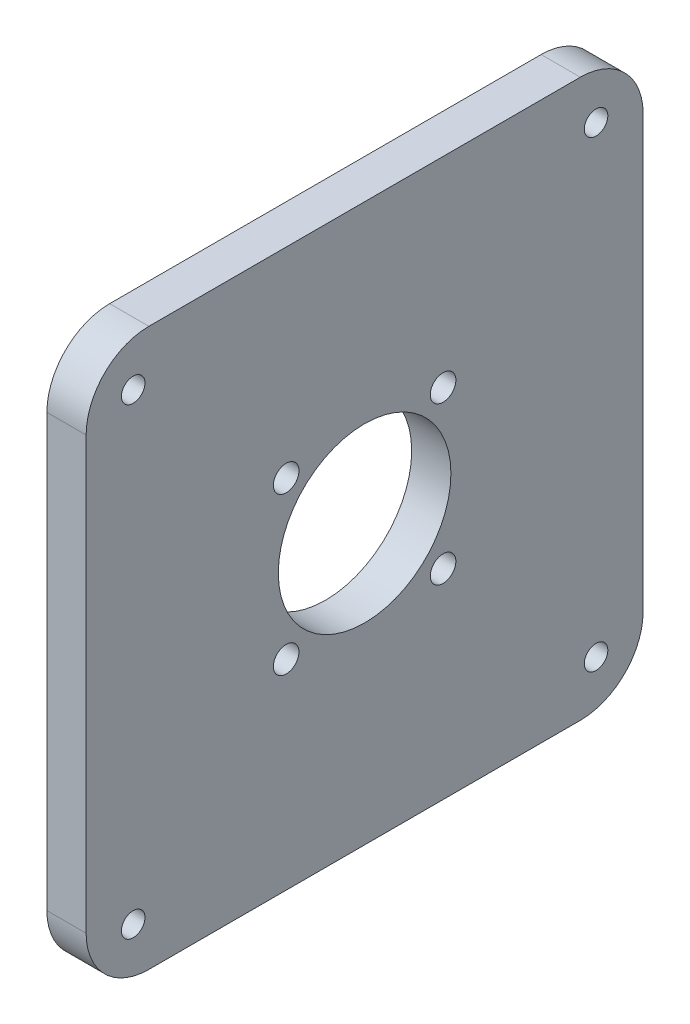
ISO-10303-21;
HEADER;
FILE_DESCRIPTION(('STEP AP214'),'2;1');
FILE_NAME('part.step','',(''),(''),'','','');
FILE_SCHEMA(('AUTOMOTIVE_DESIGN { 1 0 10303 214 1 1 1 1 }'));
ENDSEC;
DATA;
#1=APPLICATION_CONTEXT('core data for automotive mechanical design processes');
#2=APPLICATION_PROTOCOL_DEFINITION('international standard','automotive_design',2000,#1);
#3=PRODUCT_CONTEXT('',#1,'mechanical');
#4=PRODUCT('Part','Part','',(#3));
#5=PRODUCT_RELATED_PRODUCT_CATEGORY('part','',(#4));
#6=PRODUCT_DEFINITION_FORMATION('','',#4);
#7=PRODUCT_DEFINITION_CONTEXT('part definition',#1,'design');
#8=PRODUCT_DEFINITION('design','',#6,#7);
#9=PRODUCT_DEFINITION_SHAPE('','',#8);
#10=(LENGTH_UNIT() NAMED_UNIT(*) SI_UNIT(.MILLI.,.METRE.));
#11=(NAMED_UNIT(*) PLANE_ANGLE_UNIT() SI_UNIT($,.RADIAN.));
#12=(NAMED_UNIT(*) SI_UNIT($,.STERADIAN.) SOLID_ANGLE_UNIT());
#13=UNCERTAINTY_MEASURE_WITH_UNIT(LENGTH_MEASURE(1.E-05),#10,'distance_accuracy_value','');
#14=(GEOMETRIC_REPRESENTATION_CONTEXT(3) GLOBAL_UNCERTAINTY_ASSIGNED_CONTEXT((#13)) GLOBAL_UNIT_ASSIGNED_CONTEXT((#10,
#11,#12)) REPRESENTATION_CONTEXT('',''));
#15=CARTESIAN_POINT('',(0.,0.,0.));
#16=DIRECTION('',(0.,0.,1.));
#17=DIRECTION('',(1.,0.,0.));
#18=AXIS2_PLACEMENT_3D('',#15,#16,#17);
#19=CARTESIAN_POINT('',(5.,0.,0.));
#20=DIRECTION('',(-1.,0.,0.));
#21=DIRECTION('',(0.,0.,1.));
#22=AXIS2_PLACEMENT_3D('',#19,#20,#21);
#23=PLANE('',#22);
#24=CARTESIAN_POINT('',(5.,25.5,-25.5));
#25=DIRECTION('',(1.,0.,0.));
#26=DIRECTION('',(0.,0.,-1.));
#27=AXIS2_PLACEMENT_3D('',#24,#25,#26);
#28=CIRCLE('',#27,1.63195187744332);
#29=CARTESIAN_POINT('',(5.,25.5,-27.1319518774433));
#30=VERTEX_POINT('',#29);
#31=EDGE_CURVE('E218',#30,#30,#28,.T.);
#32=ORIENTED_EDGE('',*,*,#31,.F.);
#33=EDGE_LOOP('',(#32));
#34=FACE_BOUND('',#33,.T.);
#35=CARTESIAN_POINT('',(5.,45.5,-25.5));
#36=DIRECTION('',(1.,0.,0.));
#37=DIRECTION('',(0.,0.,-1.));
#38=AXIS2_PLACEMENT_3D('',#35,#36,#37);
#39=CIRCLE('',#38,1.63195187744332);
#40=CARTESIAN_POINT('',(5.,45.5,-27.1319518774433));
#41=VERTEX_POINT('',#40);
#42=EDGE_CURVE('E206',#41,#41,#39,.T.);
#43=ORIENTED_EDGE('',*,*,#42,.F.);
#44=EDGE_LOOP('',(#43));
#45=FACE_BOUND('',#44,.T.);
#46=CARTESIAN_POINT('',(5.,6.,-65.));
#47=DIRECTION('',(1.,0.,0.));
#48=DIRECTION('',(0.,0.,-1.));
#49=AXIS2_PLACEMENT_3D('',#46,#47,#48);
#50=CIRCLE('',#49,1.5);
#51=CARTESIAN_POINT('',(5.,6.,-66.5));
#52=VERTEX_POINT('',#51);
#53=EDGE_CURVE('E194',#52,#52,#50,.T.);
#54=ORIENTED_EDGE('',*,*,#53,.F.);
#55=EDGE_LOOP('',(#54));
#56=FACE_BOUND('',#55,.T.);
#57=CARTESIAN_POINT('',(5.,65.,-6.));
#58=DIRECTION('',(1.,0.,0.));
#59=DIRECTION('',(0.,0.,-1.));
#60=AXIS2_PLACEMENT_3D('',#57,#58,#59);
#61=CIRCLE('',#60,1.5);
#62=CARTESIAN_POINT('',(5.,65.,-7.5));
#63=VERTEX_POINT('',#62);
#64=EDGE_CURVE('E183',#63,#63,#61,.T.);
#65=ORIENTED_EDGE('',*,*,#64,.F.);
#66=EDGE_LOOP('',(#65));
#67=FACE_BOUND('',#66,.T.);
#68=DIRECTION('',(0.,0.,-1.));
#69=VECTOR('',#68,1.);
#70=CARTESIAN_POINT('',(5.,0.,0.));
#71=LINE('',#70,#69);
#72=CARTESIAN_POINT('',(5.,0.,-8.));
#73=VERTEX_POINT('',#72);
#74=CARTESIAN_POINT('',(5.,0.,-63.));
#75=VERTEX_POINT('',#74);
#76=EDGE_CURVE('E168',#73,#75,#71,.T.);
#77=ORIENTED_EDGE('',*,*,#76,.T.);
#78=CARTESIAN_POINT('',(5.,8.,-63.));
#79=DIRECTION('',(-1.,0.,0.));
#80=DIRECTION('',(0.,0.,1.));
#81=AXIS2_PLACEMENT_3D('',#78,#79,#80);
#82=CIRCLE('',#81,8.);
#83=CARTESIAN_POINT('',(5.,8.,-71.));
#84=VERTEX_POINT('',#83);
#85=EDGE_CURVE('E148',#75,#84,#82,.F.);
#86=ORIENTED_EDGE('',*,*,#85,.T.);
#87=DIRECTION('',(0.,1.,0.));
#88=VECTOR('',#87,1.);
#89=CARTESIAN_POINT('',(5.,0.,-71.));
#90=LINE('',#89,#88);
#91=CARTESIAN_POINT('',(5.,63.,-71.));
#92=VERTEX_POINT('',#91);
#93=EDGE_CURVE('E118',#84,#92,#90,.T.);
#94=ORIENTED_EDGE('',*,*,#93,.T.);
#95=CARTESIAN_POINT('',(5.,63.,-63.));
#96=DIRECTION('',(-1.,0.,0.));
#97=DIRECTION('',(0.,0.,1.));
#98=AXIS2_PLACEMENT_3D('',#95,#96,#97);
#99=CIRCLE('',#98,8.);
#100=CARTESIAN_POINT('',(5.,71.,-63.));
#101=VERTEX_POINT('',#100);
#102=EDGE_CURVE('E54',#92,#101,#99,.F.);
#103=ORIENTED_EDGE('',*,*,#102,.T.);
#104=DIRECTION('',(0.,0.,1.));
#105=VECTOR('',#104,1.);
#106=CARTESIAN_POINT('',(5.,71.,0.));
#107=LINE('',#106,#105);
#108=CARTESIAN_POINT('',(5.,71.,-8.));
#109=VERTEX_POINT('',#108);
#110=EDGE_CURVE('E135',#101,#109,#107,.T.);
#111=ORIENTED_EDGE('',*,*,#110,.T.);
#112=CARTESIAN_POINT('',(5.,63.,-8.));
#113=DIRECTION('',(-1.,0.,0.));
#114=DIRECTION('',(0.,0.,1.));
#115=AXIS2_PLACEMENT_3D('',#112,#113,#114);
#116=CIRCLE('',#115,8.);
#117=CARTESIAN_POINT('',(5.,63.,0.));
#118=VERTEX_POINT('',#117);
#119=EDGE_CURVE('E143',#109,#118,#116,.F.);
#120=ORIENTED_EDGE('',*,*,#119,.T.);
#121=DIRECTION('',(0.,-1.,0.));
#122=VECTOR('',#121,1.);
#123=CARTESIAN_POINT('',(5.,0.,0.));
#124=LINE('',#123,#122);
#125=CARTESIAN_POINT('',(5.,8.,0.));
#126=VERTEX_POINT('',#125);
#127=EDGE_CURVE('E129',#118,#126,#124,.T.);
#128=ORIENTED_EDGE('',*,*,#127,.T.);
#129=CARTESIAN_POINT('',(5.,8.,-8.));
#130=DIRECTION('',(-1.,0.,0.));
#131=DIRECTION('',(0.,0.,1.));
#132=AXIS2_PLACEMENT_3D('',#129,#130,#131);
#133=CIRCLE('',#132,8.);
#134=EDGE_CURVE('E146',#126,#73,#133,.F.);
#135=ORIENTED_EDGE('',*,*,#134,.T.);
#136=EDGE_LOOP('',(#77,#86,#94,#103,#111,#120,#128,#135));
#137=FACE_BOUND('',#136,.T.);
#138=CARTESIAN_POINT('',(5.,6.,-6.));
#139=DIRECTION('',(1.,0.,0.));
#140=DIRECTION('',(0.,0.,-1.));
#141=AXIS2_PLACEMENT_3D('',#138,#139,#140);
#142=CIRCLE('',#141,1.5);
#143=CARTESIAN_POINT('',(5.,6.,-7.5));
#144=VERTEX_POINT('',#143);
#145=EDGE_CURVE('E174',#144,#144,#142,.T.);
#146=ORIENTED_EDGE('',*,*,#145,.F.);
#147=EDGE_LOOP('',(#146));
#148=FACE_BOUND('',#147,.T.);
#149=CARTESIAN_POINT('',(5.,65.,-65.));
#150=DIRECTION('',(1.,0.,0.));
#151=DIRECTION('',(0.,0.,-1.));
#152=AXIS2_PLACEMENT_3D('',#149,#150,#151);
#153=CIRCLE('',#152,1.5);
#154=CARTESIAN_POINT('',(5.,65.,-66.5));
#155=VERTEX_POINT('',#154);
#156=EDGE_CURVE('E188',#155,#155,#153,.T.);
#157=ORIENTED_EDGE('',*,*,#156,.F.);
#158=EDGE_LOOP('',(#157));
#159=FACE_BOUND('',#158,.T.);
#160=CARTESIAN_POINT('',(5.,35.5,-35.5));
#161=DIRECTION('',(1.,0.,0.));
#162=DIRECTION('',(0.,0.,-1.));
#163=AXIS2_PLACEMENT_3D('',#160,#161,#162);
#164=CIRCLE('',#163,11.);
#165=CARTESIAN_POINT('',(5.,35.5,-46.5));
#166=VERTEX_POINT('',#165);
#167=EDGE_CURVE('E200',#166,#166,#164,.T.);
#168=ORIENTED_EDGE('',*,*,#167,.F.);
#169=EDGE_LOOP('',(#168));
#170=FACE_BOUND('',#169,.T.);
#171=CARTESIAN_POINT('',(5.,45.5,-45.5));
#172=DIRECTION('',(1.,0.,0.));
#173=DIRECTION('',(0.,0.,-1.));
#174=AXIS2_PLACEMENT_3D('',#171,#172,#173);
#175=CIRCLE('',#174,1.63195187744332);
#176=CARTESIAN_POINT('',(5.,45.5,-47.1319518774433));
#177=VERTEX_POINT('',#176);
#178=EDGE_CURVE('E212',#177,#177,#175,.T.);
#179=ORIENTED_EDGE('',*,*,#178,.F.);
#180=EDGE_LOOP('',(#179));
#181=FACE_BOUND('',#180,.T.);
#182=CARTESIAN_POINT('',(5.,25.5,-45.5));
#183=DIRECTION('',(1.,0.,0.));
#184=DIRECTION('',(0.,0.,-1.));
#185=AXIS2_PLACEMENT_3D('',#182,#183,#184);
#186=CIRCLE('',#185,1.63195187744332);
#187=CARTESIAN_POINT('',(5.,25.5,-47.1319518774433));
#188=VERTEX_POINT('',#187);
#189=EDGE_CURVE('E224',#188,#188,#186,.T.);
#190=ORIENTED_EDGE('',*,*,#189,.F.);
#191=EDGE_LOOP('',(#190));
#192=FACE_BOUND('',#191,.T.);
#193=ADVANCED_FACE('F33',(#34,#45,#56,#67,#137,#148,#159,#170,#181,#192),#23,.F.);
#194=CARTESIAN_POINT('',(0.,0.,0.));
#195=DIRECTION('',(-1.,0.,0.));
#196=DIRECTION('',(0.,0.,1.));
#197=AXIS2_PLACEMENT_3D('',#194,#195,#196);
#198=PLANE('',#197);
#199=CARTESIAN_POINT('',(0.,25.5,-25.5));
#200=DIRECTION('',(1.,0.,0.));
#201=DIRECTION('',(0.,0.,-1.));
#202=AXIS2_PLACEMENT_3D('',#199,#200,#201);
#203=CIRCLE('',#202,1.63195187744332);
#204=CARTESIAN_POINT('',(0.,25.5,-27.1319518774433));
#205=VERTEX_POINT('',#204);
#206=EDGE_CURVE('E221',#205,#205,#203,.T.);
#207=ORIENTED_EDGE('',*,*,#206,.T.);
#208=EDGE_LOOP('',(#207));
#209=FACE_BOUND('',#208,.T.);
#210=CARTESIAN_POINT('',(0.,45.5,-25.5));
#211=DIRECTION('',(1.,0.,0.));
#212=DIRECTION('',(0.,0.,-1.));
#213=AXIS2_PLACEMENT_3D('',#210,#211,#212);
#214=CIRCLE('',#213,1.63195187744332);
#215=CARTESIAN_POINT('',(0.,45.5,-27.1319518774433));
#216=VERTEX_POINT('',#215);
#217=EDGE_CURVE('E209',#216,#216,#214,.T.);
#218=ORIENTED_EDGE('',*,*,#217,.T.);
#219=EDGE_LOOP('',(#218));
#220=FACE_BOUND('',#219,.T.);
#221=CARTESIAN_POINT('',(0.,6.,-65.));
#222=DIRECTION('',(1.,0.,0.));
#223=DIRECTION('',(0.,0.,-1.));
#224=AXIS2_PLACEMENT_3D('',#221,#222,#223);
#225=CIRCLE('',#224,1.5);
#226=CARTESIAN_POINT('',(0.,6.,-66.5));
#227=VERTEX_POINT('',#226);
#228=EDGE_CURVE('E197',#227,#227,#225,.T.);
#229=ORIENTED_EDGE('',*,*,#228,.T.);
#230=EDGE_LOOP('',(#229));
#231=FACE_BOUND('',#230,.T.);
#232=CARTESIAN_POINT('',(0.,65.,-6.));
#233=DIRECTION('',(1.,0.,0.));
#234=DIRECTION('',(0.,0.,-1.));
#235=AXIS2_PLACEMENT_3D('',#232,#233,#234);
#236=CIRCLE('',#235,1.5);
#237=CARTESIAN_POINT('',(0.,65.,-7.5));
#238=VERTEX_POINT('',#237);
#239=EDGE_CURVE('E185',#238,#238,#236,.T.);
#240=ORIENTED_EDGE('',*,*,#239,.T.);
#241=EDGE_LOOP('',(#240));
#242=FACE_BOUND('',#241,.T.);
#243=DIRECTION('',(0.,1.,0.));
#244=VECTOR('',#243,1.);
#245=CARTESIAN_POINT('',(0.,0.,-71.));
#246=LINE('',#245,#244);
#247=CARTESIAN_POINT('',(0.,8.,-71.));
#248=VERTEX_POINT('',#247);
#249=CARTESIAN_POINT('',(0.,63.,-71.));
#250=VERTEX_POINT('',#249);
#251=EDGE_CURVE('E116',#248,#250,#246,.T.);
#252=ORIENTED_EDGE('',*,*,#251,.F.);
#253=CARTESIAN_POINT('',(0.,8.,-63.));
#254=DIRECTION('',(-1.,0.,0.));
#255=DIRECTION('',(0.,0.,1.));
#256=AXIS2_PLACEMENT_3D('',#253,#254,#255);
#257=CIRCLE('',#256,8.);
#258=CARTESIAN_POINT('',(0.,0.,-63.));
#259=VERTEX_POINT('',#258);
#260=EDGE_CURVE('E99',#248,#259,#257,.T.);
#261=ORIENTED_EDGE('',*,*,#260,.T.);
#262=DIRECTION('',(0.,0.,-1.));
#263=VECTOR('',#262,1.);
#264=CARTESIAN_POINT('',(0.,0.,0.));
#265=LINE('',#264,#263);
#266=CARTESIAN_POINT('',(0.,0.,-8.));
#267=VERTEX_POINT('',#266);
#268=EDGE_CURVE('E127',#267,#259,#265,.T.);
#269=ORIENTED_EDGE('',*,*,#268,.F.);
#270=CARTESIAN_POINT('',(0.,8.,-8.));
#271=DIRECTION('',(-1.,0.,0.));
#272=DIRECTION('',(0.,0.,1.));
#273=AXIS2_PLACEMENT_3D('',#270,#271,#272);
#274=CIRCLE('',#273,8.);
#275=CARTESIAN_POINT('',(0.,8.,0.));
#276=VERTEX_POINT('',#275);
#277=EDGE_CURVE('E110',#267,#276,#274,.T.);
#278=ORIENTED_EDGE('',*,*,#277,.T.);
#279=DIRECTION('',(0.,-1.,0.));
#280=VECTOR('',#279,1.);
#281=CARTESIAN_POINT('',(0.,0.,0.));
#282=LINE('',#281,#280);
#283=CARTESIAN_POINT('',(0.,63.,0.));
#284=VERTEX_POINT('',#283);
#285=EDGE_CURVE('E131',#284,#276,#282,.T.);
#286=ORIENTED_EDGE('',*,*,#285,.F.);
#287=CARTESIAN_POINT('',(0.,63.,-8.));
#288=DIRECTION('',(-1.,0.,0.));
#289=DIRECTION('',(0.,0.,1.));
#290=AXIS2_PLACEMENT_3D('',#287,#288,#289);
#291=CIRCLE('',#290,8.);
#292=CARTESIAN_POINT('',(0.,71.,-8.));
#293=VERTEX_POINT('',#292);
#294=EDGE_CURVE('E119',#284,#293,#291,.T.);
#295=ORIENTED_EDGE('',*,*,#294,.T.);
#296=DIRECTION('',(0.,0.,1.));
#297=VECTOR('',#296,1.);
#298=CARTESIAN_POINT('',(0.,71.,0.));
#299=LINE('',#298,#297);
#300=CARTESIAN_POINT('',(0.,71.,-63.));
#301=VERTEX_POINT('',#300);
#302=EDGE_CURVE('E126',#301,#293,#299,.T.);
#303=ORIENTED_EDGE('',*,*,#302,.F.);
#304=CARTESIAN_POINT('',(0.,63.,-63.));
#305=DIRECTION('',(-1.,0.,0.));
#306=DIRECTION('',(0.,0.,1.));
#307=AXIS2_PLACEMENT_3D('',#304,#305,#306);
#308=CIRCLE('',#307,8.);
#309=EDGE_CURVE('E125',#301,#250,#308,.T.);
#310=ORIENTED_EDGE('',*,*,#309,.T.);
#311=EDGE_LOOP('',(#252,#261,#269,#278,#286,#295,#303,#310));
#312=FACE_BOUND('',#311,.T.);
#313=CARTESIAN_POINT('',(0.,6.,-6.));
#314=DIRECTION('',(1.,0.,0.));
#315=DIRECTION('',(0.,0.,-1.));
#316=AXIS2_PLACEMENT_3D('',#313,#314,#315);
#317=CIRCLE('',#316,1.5);
#318=CARTESIAN_POINT('',(0.,6.,-7.5));
#319=VERTEX_POINT('',#318);
#320=EDGE_CURVE('E176',#319,#319,#317,.T.);
#321=ORIENTED_EDGE('',*,*,#320,.T.);
#322=EDGE_LOOP('',(#321));
#323=FACE_BOUND('',#322,.T.);
#324=CARTESIAN_POINT('',(0.,65.,-65.));
#325=DIRECTION('',(1.,0.,0.));
#326=DIRECTION('',(0.,0.,-1.));
#327=AXIS2_PLACEMENT_3D('',#324,#325,#326);
#328=CIRCLE('',#327,1.5);
#329=CARTESIAN_POINT('',(0.,65.,-66.5));
#330=VERTEX_POINT('',#329);
#331=EDGE_CURVE('E191',#330,#330,#328,.T.);
#332=ORIENTED_EDGE('',*,*,#331,.T.);
#333=EDGE_LOOP('',(#332));
#334=FACE_BOUND('',#333,.T.);
#335=CARTESIAN_POINT('',(0.,35.5,-35.5));
#336=DIRECTION('',(1.,0.,0.));
#337=DIRECTION('',(0.,0.,-1.));
#338=AXIS2_PLACEMENT_3D('',#335,#336,#337);
#339=CIRCLE('',#338,11.);
#340=CARTESIAN_POINT('',(0.,35.5,-46.5));
#341=VERTEX_POINT('',#340);
#342=EDGE_CURVE('E203',#341,#341,#339,.T.);
#343=ORIENTED_EDGE('',*,*,#342,.T.);
#344=EDGE_LOOP('',(#343));
#345=FACE_BOUND('',#344,.T.);
#346=CARTESIAN_POINT('',(0.,45.5,-45.5));
#347=DIRECTION('',(1.,0.,0.));
#348=DIRECTION('',(0.,0.,-1.));
#349=AXIS2_PLACEMENT_3D('',#346,#347,#348);
#350=CIRCLE('',#349,1.63195187744332);
#351=CARTESIAN_POINT('',(0.,45.5,-47.1319518774433));
#352=VERTEX_POINT('',#351);
#353=EDGE_CURVE('E215',#352,#352,#350,.T.);
#354=ORIENTED_EDGE('',*,*,#353,.T.);
#355=EDGE_LOOP('',(#354));
#356=FACE_BOUND('',#355,.T.);
#357=CARTESIAN_POINT('',(0.,25.5,-45.5));
#358=DIRECTION('',(1.,0.,0.));
#359=DIRECTION('',(0.,0.,-1.));
#360=AXIS2_PLACEMENT_3D('',#357,#358,#359);
#361=CIRCLE('',#360,1.63195187744332);
#362=CARTESIAN_POINT('',(0.,25.5,-47.1319518774433));
#363=VERTEX_POINT('',#362);
#364=EDGE_CURVE('E227',#363,#363,#361,.T.);
#365=ORIENTED_EDGE('',*,*,#364,.T.);
#366=EDGE_LOOP('',(#365));
#367=FACE_BOUND('',#366,.T.);
#368=ADVANCED_FACE('F122',(#209,#220,#231,#242,#312,#323,#334,#345,#356,#367),#198,.T.);
#369=CARTESIAN_POINT('',(5.,0.,0.));
#370=DIRECTION('',(0.,0.,-1.));
#371=DIRECTION('',(-1.,0.,0.));
#372=AXIS2_PLACEMENT_3D('',#369,#370,#371);
#373=PLANE('',#372);
#374=ORIENTED_EDGE('',*,*,#285,.T.);
#375=DIRECTION('',(-1.,0.,0.));
#376=VECTOR('',#375,1.);
#377=CARTESIAN_POINT('',(5.,8.,0.));
#378=LINE('',#377,#376);
#379=EDGE_CURVE('E153',#276,#126,#378,.F.);
#380=ORIENTED_EDGE('',*,*,#379,.T.);
#381=ORIENTED_EDGE('',*,*,#127,.F.);
#382=DIRECTION('',(-1.,0.,0.));
#383=VECTOR('',#382,1.);
#384=CARTESIAN_POINT('',(5.,63.,0.));
#385=LINE('',#384,#383);
#386=EDGE_CURVE('E150',#118,#284,#385,.T.);
#387=ORIENTED_EDGE('',*,*,#386,.T.);
#388=EDGE_LOOP('',(#374,#380,#381,#387));
#389=FACE_BOUND('',#388,.T.);
#390=ADVANCED_FACE('F159',(#389),#373,.F.);
#391=CARTESIAN_POINT('',(5.,0.,0.));
#392=DIRECTION('',(0.,1.,0.));
#393=DIRECTION('',(0.,0.,1.));
#394=AXIS2_PLACEMENT_3D('',#391,#392,#393);
#395=PLANE('',#394);
#396=ORIENTED_EDGE('',*,*,#268,.T.);
#397=DIRECTION('',(-1.,0.,0.));
#398=VECTOR('',#397,1.);
#399=CARTESIAN_POINT('',(5.,0.,-63.));
#400=LINE('',#399,#398);
#401=EDGE_CURVE('E104',#259,#75,#400,.F.);
#402=ORIENTED_EDGE('',*,*,#401,.T.);
#403=ORIENTED_EDGE('',*,*,#76,.F.);
#404=DIRECTION('',(-1.,0.,0.));
#405=VECTOR('',#404,1.);
#406=CARTESIAN_POINT('',(5.,0.,-8.));
#407=LINE('',#406,#405);
#408=EDGE_CURVE('E109',#73,#267,#407,.T.);
#409=ORIENTED_EDGE('',*,*,#408,.T.);
#410=EDGE_LOOP('',(#396,#402,#403,#409));
#411=FACE_BOUND('',#410,.T.);
#412=ADVANCED_FACE('F173',(#411),#395,.F.);
#413=CARTESIAN_POINT('',(5.,0.,-71.));
#414=DIRECTION('',(0.,0.,1.));
#415=DIRECTION('',(1.,0.,0.));
#416=AXIS2_PLACEMENT_3D('',#413,#414,#415);
#417=PLANE('',#416);
#418=ORIENTED_EDGE('',*,*,#93,.F.);
#419=DIRECTION('',(-1.,0.,0.));
#420=VECTOR('',#419,1.);
#421=CARTESIAN_POINT('',(5.,8.,-71.));
#422=LINE('',#421,#420);
#423=EDGE_CURVE('E103',#84,#248,#422,.T.);
#424=ORIENTED_EDGE('',*,*,#423,.T.);
#425=ORIENTED_EDGE('',*,*,#251,.T.);
#426=DIRECTION('',(-1.,0.,0.));
#427=VECTOR('',#426,1.);
#428=CARTESIAN_POINT('',(5.,63.,-71.));
#429=LINE('',#428,#427);
#430=EDGE_CURVE('E120',#250,#92,#429,.F.);
#431=ORIENTED_EDGE('',*,*,#430,.T.);
#432=EDGE_LOOP('',(#418,#424,#425,#431));
#433=FACE_BOUND('',#432,.T.);
#434=ADVANCED_FACE('F115',(#433),#417,.F.);
#435=CARTESIAN_POINT('',(5.,71.,0.));
#436=DIRECTION('',(0.,-1.,0.));
#437=DIRECTION('',(0.,0.,-1.));
#438=AXIS2_PLACEMENT_3D('',#435,#436,#437);
#439=PLANE('',#438);
#440=ORIENTED_EDGE('',*,*,#110,.F.);
#441=DIRECTION('',(-1.,0.,0.));
#442=VECTOR('',#441,1.);
#443=CARTESIAN_POINT('',(5.,71.,-63.));
#444=LINE('',#443,#442);
#445=EDGE_CURVE('E11',#101,#301,#444,.T.);
#446=ORIENTED_EDGE('',*,*,#445,.T.);
#447=ORIENTED_EDGE('',*,*,#302,.T.);
#448=DIRECTION('',(-1.,0.,0.));
#449=VECTOR('',#448,1.);
#450=CARTESIAN_POINT('',(5.,71.,-8.));
#451=LINE('',#450,#449);
#452=EDGE_CURVE('E41',#293,#109,#451,.F.);
#453=ORIENTED_EDGE('',*,*,#452,.T.);
#454=EDGE_LOOP('',(#440,#446,#447,#453));
#455=FACE_BOUND('',#454,.T.);
#456=ADVANCED_FACE('F250',(#455),#439,.F.);
#457=CARTESIAN_POINT('',(5.,6.,-6.));
#458=DIRECTION('',(-1.,0.,0.));
#459=DIRECTION('',(0.,0.,1.));
#460=AXIS2_PLACEMENT_3D('',#457,#458,#459);
#461=CYLINDRICAL_SURFACE('',#460,1.5);
#462=ORIENTED_EDGE('',*,*,#145,.T.);
#463=EDGE_LOOP('',(#462));
#464=FACE_BOUND('',#463,.T.);
#465=ORIENTED_EDGE('',*,*,#320,.F.);
#466=EDGE_LOOP('',(#465));
#467=FACE_BOUND('',#466,.T.);
#468=ADVANCED_FACE('F247',(#464,#467),#461,.F.);
#469=CARTESIAN_POINT('',(5.,65.,-6.));
#470=DIRECTION('',(-1.,0.,0.));
#471=DIRECTION('',(0.,0.,1.));
#472=AXIS2_PLACEMENT_3D('',#469,#470,#471);
#473=CYLINDRICAL_SURFACE('',#472,1.5);
#474=ORIENTED_EDGE('',*,*,#64,.T.);
#475=EDGE_LOOP('',(#474));
#476=FACE_BOUND('',#475,.T.);
#477=ORIENTED_EDGE('',*,*,#239,.F.);
#478=EDGE_LOOP('',(#477));
#479=FACE_BOUND('',#478,.T.);
#480=ADVANCED_FACE('F392',(#476,#479),#473,.F.);
#481=CARTESIAN_POINT('',(5.,65.,-65.));
#482=DIRECTION('',(-1.,0.,0.));
#483=DIRECTION('',(0.,0.,1.));
#484=AXIS2_PLACEMENT_3D('',#481,#482,#483);
#485=CYLINDRICAL_SURFACE('',#484,1.5);
#486=ORIENTED_EDGE('',*,*,#156,.T.);
#487=EDGE_LOOP('',(#486));
#488=FACE_BOUND('',#487,.T.);
#489=ORIENTED_EDGE('',*,*,#331,.F.);
#490=EDGE_LOOP('',(#489));
#491=FACE_BOUND('',#490,.T.);
#492=ADVANCED_FACE('F382',(#488,#491),#485,.F.);
#493=CARTESIAN_POINT('',(5.,6.,-65.));
#494=DIRECTION('',(-1.,0.,0.));
#495=DIRECTION('',(0.,0.,1.));
#496=AXIS2_PLACEMENT_3D('',#493,#494,#495);
#497=CYLINDRICAL_SURFACE('',#496,1.5);
#498=ORIENTED_EDGE('',*,*,#53,.T.);
#499=EDGE_LOOP('',(#498));
#500=FACE_BOUND('',#499,.T.);
#501=ORIENTED_EDGE('',*,*,#228,.F.);
#502=EDGE_LOOP('',(#501));
#503=FACE_BOUND('',#502,.T.);
#504=ADVANCED_FACE('F372',(#500,#503),#497,.F.);
#505=CARTESIAN_POINT('',(5.,35.5,-35.5));
#506=DIRECTION('',(-1.,0.,0.));
#507=DIRECTION('',(0.,0.,1.));
#508=AXIS2_PLACEMENT_3D('',#505,#506,#507);
#509=CYLINDRICAL_SURFACE('',#508,11.);
#510=ORIENTED_EDGE('',*,*,#167,.T.);
#511=EDGE_LOOP('',(#510));
#512=FACE_BOUND('',#511,.T.);
#513=ORIENTED_EDGE('',*,*,#342,.F.);
#514=EDGE_LOOP('',(#513));
#515=FACE_BOUND('',#514,.T.);
#516=ADVANCED_FACE('F362',(#512,#515),#509,.F.);
#517=CARTESIAN_POINT('',(5.,45.5,-25.5));
#518=DIRECTION('',(-1.,0.,0.));
#519=DIRECTION('',(0.,0.,1.));
#520=AXIS2_PLACEMENT_3D('',#517,#518,#519);
#521=CYLINDRICAL_SURFACE('',#520,1.63195187744332);
#522=ORIENTED_EDGE('',*,*,#42,.T.);
#523=EDGE_LOOP('',(#522));
#524=FACE_BOUND('',#523,.T.);
#525=ORIENTED_EDGE('',*,*,#217,.F.);
#526=EDGE_LOOP('',(#525));
#527=FACE_BOUND('',#526,.T.);
#528=ADVANCED_FACE('F352',(#524,#527),#521,.F.);
#529=CARTESIAN_POINT('',(5.,45.5,-45.5));
#530=DIRECTION('',(-1.,0.,0.));
#531=DIRECTION('',(0.,0.,1.));
#532=AXIS2_PLACEMENT_3D('',#529,#530,#531);
#533=CYLINDRICAL_SURFACE('',#532,1.63195187744332);
#534=ORIENTED_EDGE('',*,*,#178,.T.);
#535=EDGE_LOOP('',(#534));
#536=FACE_BOUND('',#535,.T.);
#537=ORIENTED_EDGE('',*,*,#353,.F.);
#538=EDGE_LOOP('',(#537));
#539=FACE_BOUND('',#538,.T.);
#540=ADVANCED_FACE('F342',(#536,#539),#533,.F.);
#541=CARTESIAN_POINT('',(5.,25.5,-25.5));
#542=DIRECTION('',(-1.,0.,0.));
#543=DIRECTION('',(0.,0.,1.));
#544=AXIS2_PLACEMENT_3D('',#541,#542,#543);
#545=CYLINDRICAL_SURFACE('',#544,1.63195187744332);
#546=ORIENTED_EDGE('',*,*,#31,.T.);
#547=EDGE_LOOP('',(#546));
#548=FACE_BOUND('',#547,.T.);
#549=ORIENTED_EDGE('',*,*,#206,.F.);
#550=EDGE_LOOP('',(#549));
#551=FACE_BOUND('',#550,.T.);
#552=ADVANCED_FACE('F333',(#548,#551),#545,.F.);
#553=CARTESIAN_POINT('',(5.,25.5,-45.5));
#554=DIRECTION('',(-1.,0.,0.));
#555=DIRECTION('',(0.,0.,1.));
#556=AXIS2_PLACEMENT_3D('',#553,#554,#555);
#557=CYLINDRICAL_SURFACE('',#556,1.63195187744332);
#558=ORIENTED_EDGE('',*,*,#189,.T.);
#559=EDGE_LOOP('',(#558));
#560=FACE_BOUND('',#559,.T.);
#561=ORIENTED_EDGE('',*,*,#364,.F.);
#562=EDGE_LOOP('',(#561));
#563=FACE_BOUND('',#562,.T.);
#564=ADVANCED_FACE('F233',(#560,#563),#557,.F.);
#565=CARTESIAN_POINT('',(5.,8.,-63.));
#566=DIRECTION('',(-1.,0.,0.));
#567=DIRECTION('',(0.,0.,1.));
#568=AXIS2_PLACEMENT_3D('',#565,#566,#567);
#569=CYLINDRICAL_SURFACE('',#568,8.);
#570=ORIENTED_EDGE('',*,*,#85,.F.);
#571=ORIENTED_EDGE('',*,*,#401,.F.);
#572=ORIENTED_EDGE('',*,*,#260,.F.);
#573=ORIENTED_EDGE('',*,*,#423,.F.);
#574=EDGE_LOOP('',(#570,#571,#572,#573));
#575=FACE_BOUND('',#574,.T.);
#576=ADVANCED_FACE('F102',(#575),#569,.T.);
#577=CARTESIAN_POINT('',(5.,8.,-8.));
#578=DIRECTION('',(-1.,0.,0.));
#579=DIRECTION('',(0.,0.,1.));
#580=AXIS2_PLACEMENT_3D('',#577,#578,#579);
#581=CYLINDRICAL_SURFACE('',#580,8.);
#582=ORIENTED_EDGE('',*,*,#134,.F.);
#583=ORIENTED_EDGE('',*,*,#379,.F.);
#584=ORIENTED_EDGE('',*,*,#277,.F.);
#585=ORIENTED_EDGE('',*,*,#408,.F.);
#586=EDGE_LOOP('',(#582,#583,#584,#585));
#587=FACE_BOUND('',#586,.T.);
#588=ADVANCED_FACE('F171',(#587),#581,.T.);
#589=CARTESIAN_POINT('',(5.,63.,-63.));
#590=DIRECTION('',(-1.,0.,0.));
#591=DIRECTION('',(0.,0.,1.));
#592=AXIS2_PLACEMENT_3D('',#589,#590,#591);
#593=CYLINDRICAL_SURFACE('',#592,8.);
#594=ORIENTED_EDGE('',*,*,#102,.F.);
#595=ORIENTED_EDGE('',*,*,#430,.F.);
#596=ORIENTED_EDGE('',*,*,#309,.F.);
#597=ORIENTED_EDGE('',*,*,#445,.F.);
#598=EDGE_LOOP('',(#594,#595,#596,#597));
#599=FACE_BOUND('',#598,.T.);
#600=ADVANCED_FACE('F262',(#599),#593,.T.);
#601=CARTESIAN_POINT('',(5.,63.,-8.));
#602=DIRECTION('',(-1.,0.,0.));
#603=DIRECTION('',(0.,0.,1.));
#604=AXIS2_PLACEMENT_3D('',#601,#602,#603);
#605=CYLINDRICAL_SURFACE('',#604,8.);
#606=ORIENTED_EDGE('',*,*,#119,.F.);
#607=ORIENTED_EDGE('',*,*,#452,.F.);
#608=ORIENTED_EDGE('',*,*,#294,.F.);
#609=ORIENTED_EDGE('',*,*,#386,.F.);
#610=EDGE_LOOP('',(#606,#607,#608,#609));
#611=FACE_BOUND('',#610,.T.);
#612=ADVANCED_FACE('F35',(#611),#605,.T.);
#613=CLOSED_SHELL('',(#193,#368,#390,#412,#434,#456,#468,#480,#492,#504,#516,#528,#540,#552,
#564,#576,#588,#600,#612));
#614=MANIFOLD_SOLID_BREP('B2',#613);
#615=ADVANCED_BREP_SHAPE_REPRESENTATION('',(#18,#614),#14);
#616=SHAPE_DEFINITION_REPRESENTATION(#9,#615);
ENDSEC;
END-ISO-10303-21;
